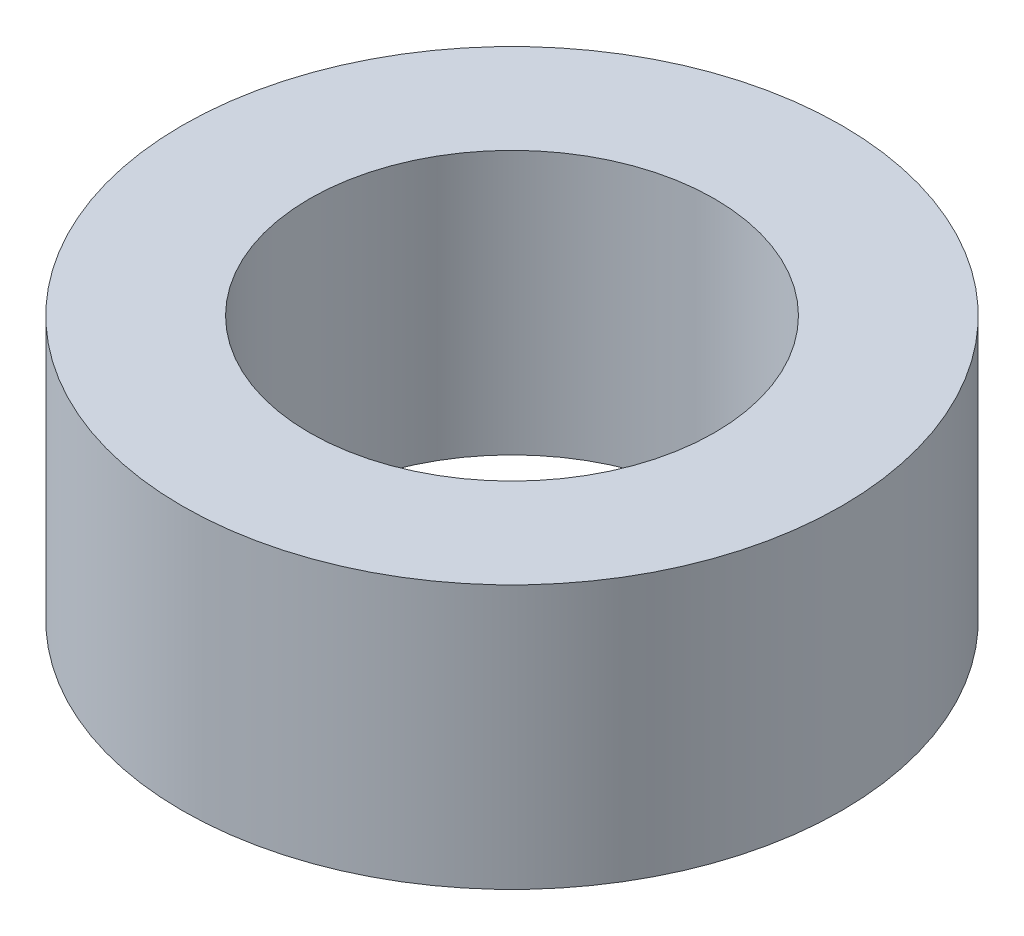
ISO-10303-21;
HEADER;
FILE_DESCRIPTION(('STEP AP214'),'2;1');
FILE_NAME('part.step','',(''),(''),'','','');
FILE_SCHEMA(('AUTOMOTIVE_DESIGN { 1 0 10303 214 1 1 1 1 }'));
ENDSEC;
DATA;
#1=APPLICATION_CONTEXT('core data for automotive mechanical design processes');
#2=APPLICATION_PROTOCOL_DEFINITION('international standard','automotive_design',2000,#1);
#3=PRODUCT_CONTEXT('',#1,'mechanical');
#4=PRODUCT('Part','Part','',(#3));
#5=PRODUCT_RELATED_PRODUCT_CATEGORY('part','',(#4));
#6=PRODUCT_DEFINITION_FORMATION('','',#4);
#7=PRODUCT_DEFINITION_CONTEXT('part definition',#1,'design');
#8=PRODUCT_DEFINITION('design','',#6,#7);
#9=PRODUCT_DEFINITION_SHAPE('','',#8);
#10=(LENGTH_UNIT() NAMED_UNIT(*) SI_UNIT(.MILLI.,.METRE.));
#11=(NAMED_UNIT(*) PLANE_ANGLE_UNIT() SI_UNIT($,.RADIAN.));
#12=(NAMED_UNIT(*) SI_UNIT($,.STERADIAN.) SOLID_ANGLE_UNIT());
#13=UNCERTAINTY_MEASURE_WITH_UNIT(LENGTH_MEASURE(1.E-05),#10,'distance_accuracy_value','');
#14=(GEOMETRIC_REPRESENTATION_CONTEXT(3) GLOBAL_UNCERTAINTY_ASSIGNED_CONTEXT((#13)) GLOBAL_UNIT_ASSIGNED_CONTEXT((#10,
#11,#12)) REPRESENTATION_CONTEXT('',''));
#15=CARTESIAN_POINT('',(0.,0.,0.));
#16=DIRECTION('',(0.,0.,1.));
#17=DIRECTION('',(1.,0.,0.));
#18=AXIS2_PLACEMENT_3D('',#15,#16,#17);
#19=CARTESIAN_POINT('',(0.,0.,0.));
#20=DIRECTION('',(0.,1.,0.));
#21=DIRECTION('',(0.,0.,1.));
#22=AXIS2_PLACEMENT_3D('',#19,#20,#21);
#23=CYLINDRICAL_SURFACE('',#22,2.4384);
#24=CARTESIAN_POINT('',(0.,3.175,0.));
#25=DIRECTION('',(0.,1.,0.));
#26=DIRECTION('',(0.,0.,1.));
#27=AXIS2_PLACEMENT_3D('',#24,#25,#26);
#28=CIRCLE('',#27,2.4384);
#29=CARTESIAN_POINT('',(0.,3.175,2.4384));
#30=VERTEX_POINT('',#29);
#31=EDGE_CURVE('E18',#30,#30,#28,.F.);
#32=ORIENTED_EDGE('',*,*,#31,.F.);
#33=EDGE_LOOP('',(#32));
#34=FACE_BOUND('',#33,.T.);
#35=CARTESIAN_POINT('',(0.,0.,0.));
#36=DIRECTION('',(0.,1.,0.));
#37=DIRECTION('',(0.,0.,1.));
#38=AXIS2_PLACEMENT_3D('',#35,#36,#37);
#39=CIRCLE('',#38,2.4384);
#40=CARTESIAN_POINT('',(0.,0.,2.4384));
#41=VERTEX_POINT('',#40);
#42=EDGE_CURVE('E32',#41,#41,#39,.F.);
#43=ORIENTED_EDGE('',*,*,#42,.T.);
#44=EDGE_LOOP('',(#43));
#45=FACE_BOUND('',#44,.T.);
#46=ADVANCED_FACE('F15',(#34,#45),#23,.F.);
#47=CARTESIAN_POINT('',(0.,3.175,0.));
#48=DIRECTION('',(0.,1.,0.));
#49=DIRECTION('',(0.,0.,1.));
#50=AXIS2_PLACEMENT_3D('',#47,#48,#49);
#51=PLANE('',#50);
#52=ORIENTED_EDGE('',*,*,#31,.T.);
#53=EDGE_LOOP('',(#52));
#54=FACE_BOUND('',#53,.T.);
#55=CARTESIAN_POINT('',(0.,3.175,0.));
#56=DIRECTION('',(0.,1.,0.));
#57=DIRECTION('',(0.,0.,1.));
#58=AXIS2_PLACEMENT_3D('',#55,#56,#57);
#59=CIRCLE('',#58,3.96875);
#60=CARTESIAN_POINT('',(0.,3.175,3.96875));
#61=VERTEX_POINT('',#60);
#62=EDGE_CURVE('E23',#61,#61,#59,.F.);
#63=ORIENTED_EDGE('',*,*,#62,.F.);
#64=EDGE_LOOP('',(#63));
#65=FACE_BOUND('',#64,.T.);
#66=ADVANCED_FACE('F40',(#54,#65),#51,.T.);
#67=CARTESIAN_POINT('',(0.,0.,0.));
#68=DIRECTION('',(0.,1.,0.));
#69=DIRECTION('',(0.,0.,1.));
#70=AXIS2_PLACEMENT_3D('',#67,#68,#69);
#71=PLANE('',#70);
#72=ORIENTED_EDGE('',*,*,#42,.F.);
#73=EDGE_LOOP('',(#72));
#74=FACE_BOUND('',#73,.T.);
#75=CARTESIAN_POINT('',(0.,0.,0.));
#76=DIRECTION('',(0.,1.,0.));
#77=DIRECTION('',(0.,0.,1.));
#78=AXIS2_PLACEMENT_3D('',#75,#76,#77);
#79=CIRCLE('',#78,3.96875);
#80=CARTESIAN_POINT('',(0.,0.,3.96875));
#81=VERTEX_POINT('',#80);
#82=EDGE_CURVE('E10',#81,#81,#79,.T.);
#83=ORIENTED_EDGE('',*,*,#82,.F.);
#84=EDGE_LOOP('',(#83));
#85=FACE_BOUND('',#84,.T.);
#86=ADVANCED_FACE('F48',(#74,#85),#71,.F.);
#87=CARTESIAN_POINT('',(0.,0.,0.));
#88=DIRECTION('',(0.,1.,0.));
#89=DIRECTION('',(0.,0.,1.));
#90=AXIS2_PLACEMENT_3D('',#87,#88,#89);
#91=CYLINDRICAL_SURFACE('',#90,3.96875);
#92=ORIENTED_EDGE('',*,*,#62,.T.);
#93=EDGE_LOOP('',(#92));
#94=FACE_BOUND('',#93,.T.);
#95=ORIENTED_EDGE('',*,*,#82,.T.);
#96=EDGE_LOOP('',(#95));
#97=FACE_BOUND('',#96,.T.);
#98=ADVANCED_FACE('F49',(#94,#97),#91,.T.);
#99=CLOSED_SHELL('',(#46,#66,#86,#98));
#100=MANIFOLD_SOLID_BREP('B1',#99);
#101=ADVANCED_BREP_SHAPE_REPRESENTATION('',(#18,#100),#14);
#102=SHAPE_DEFINITION_REPRESENTATION(#9,#101);
ENDSEC;
END-ISO-10303-21;
